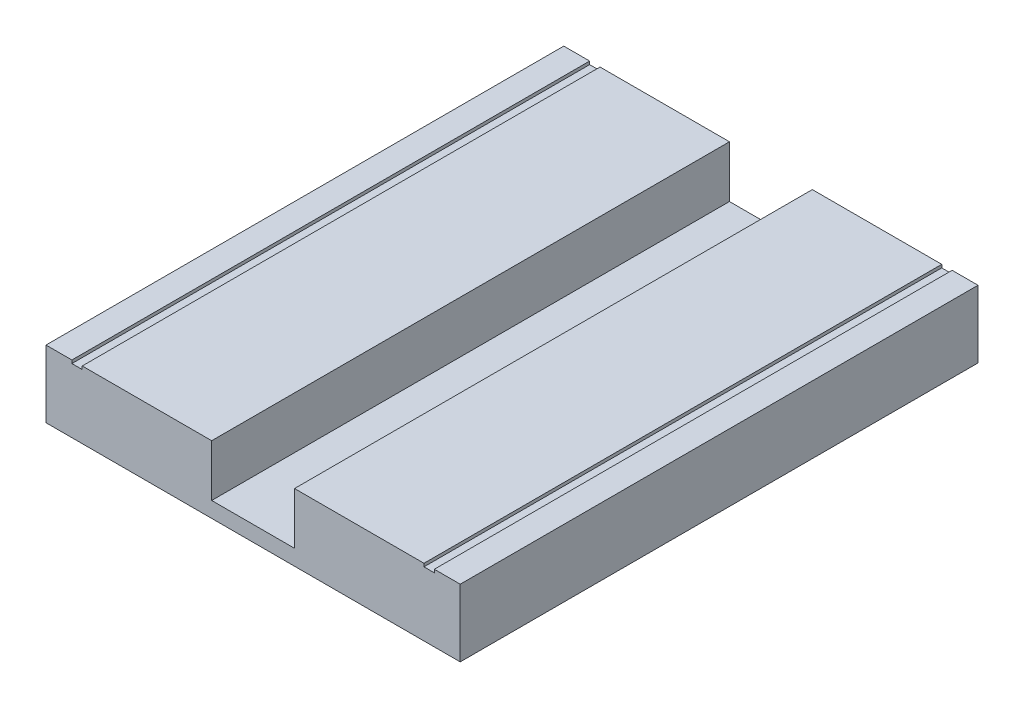
ISO-10303-21;
HEADER;
FILE_DESCRIPTION(('STEP AP214'),'2;1');
FILE_NAME('part.step','',(''),(''),'','','');
FILE_SCHEMA(('AUTOMOTIVE_DESIGN { 1 0 10303 214 1 1 1 1 }'));
ENDSEC;
DATA;
#1=APPLICATION_CONTEXT('core data for automotive mechanical design processes');
#2=APPLICATION_PROTOCOL_DEFINITION('international standard','automotive_design',2000,#1);
#3=PRODUCT_CONTEXT('',#1,'mechanical');
#4=PRODUCT('Part','Part','',(#3));
#5=PRODUCT_RELATED_PRODUCT_CATEGORY('part','',(#4));
#6=PRODUCT_DEFINITION_FORMATION('','',#4);
#7=PRODUCT_DEFINITION_CONTEXT('part definition',#1,'design');
#8=PRODUCT_DEFINITION('design','',#6,#7);
#9=PRODUCT_DEFINITION_SHAPE('','',#8);
#10=(LENGTH_UNIT() NAMED_UNIT(*) SI_UNIT(.MILLI.,.METRE.));
#11=(NAMED_UNIT(*) PLANE_ANGLE_UNIT() SI_UNIT($,.RADIAN.));
#12=(NAMED_UNIT(*) SI_UNIT($,.STERADIAN.) SOLID_ANGLE_UNIT());
#13=UNCERTAINTY_MEASURE_WITH_UNIT(LENGTH_MEASURE(1.E-05),#10,'distance_accuracy_value','');
#14=(GEOMETRIC_REPRESENTATION_CONTEXT(3) GLOBAL_UNCERTAINTY_ASSIGNED_CONTEXT((#13)) GLOBAL_UNIT_ASSIGNED_CONTEXT((#10,
#11,#12)) REPRESENTATION_CONTEXT('',''));
#15=CARTESIAN_POINT('',(0.,0.,0.));
#16=DIRECTION('',(0.,0.,1.));
#17=DIRECTION('',(1.,0.,0.));
#18=AXIS2_PLACEMENT_3D('',#15,#16,#17);
#19=CARTESIAN_POINT('',(0.,-10.,0.));
#20=DIRECTION('',(0.,-1.,0.));
#21=DIRECTION('',(0.,0.,-1.));
#22=AXIS2_PLACEMENT_3D('',#19,#20,#21);
#23=PLANE('',#22);
#24=DIRECTION('',(0.,0.,1.));
#25=VECTOR('',#24,1.);
#26=CARTESIAN_POINT('',(-7.99999999999999,-10.,100.));
#27=LINE('',#26,#25);
#28=CARTESIAN_POINT('',(-8.,-10.,0.));
#29=VERTEX_POINT('',#28);
#30=CARTESIAN_POINT('',(-7.99999999999999,-10.,100.));
#31=VERTEX_POINT('',#30);
#32=EDGE_CURVE('E149',#29,#31,#27,.T.);
#33=ORIENTED_EDGE('',*,*,#32,.T.);
#34=DIRECTION('',(-1.,0.,0.));
#35=VECTOR('',#34,1.);
#36=CARTESIAN_POINT('',(40.,-10.,100.));
#37=LINE('',#36,#35);
#38=CARTESIAN_POINT('',(8.,-10.,100.));
#39=VERTEX_POINT('',#38);
#40=EDGE_CURVE('E153',#39,#31,#37,.T.);
#41=ORIENTED_EDGE('',*,*,#40,.F.);
#42=DIRECTION('',(0.,0.,-1.));
#43=VECTOR('',#42,1.);
#44=CARTESIAN_POINT('',(8.,-10.,100.));
#45=LINE('',#44,#43);
#46=CARTESIAN_POINT('',(8.,-10.,0.));
#47=VERTEX_POINT('',#46);
#48=EDGE_CURVE('E50',#39,#47,#45,.T.);
#49=ORIENTED_EDGE('',*,*,#48,.T.);
#50=DIRECTION('',(1.,0.,0.));
#51=VECTOR('',#50,1.);
#52=CARTESIAN_POINT('',(40.,-10.,0.));
#53=LINE('',#52,#51);
#54=EDGE_CURVE('E186',#29,#47,#53,.T.);
#55=ORIENTED_EDGE('',*,*,#54,.F.);
#56=EDGE_LOOP('',(#33,#41,#49,#55));
#57=FACE_BOUND('',#56,.T.);
#58=ADVANCED_FACE('F33',(#57),#23,.F.);
#59=CARTESIAN_POINT('',(-40.,0.,100.));
#60=DIRECTION('',(0.,1.,0.));
#61=DIRECTION('',(0.,0.,1.));
#62=AXIS2_PLACEMENT_3D('',#59,#60,#61);
#63=PLANE('',#62);
#64=DIRECTION('',(0.,0.,-1.));
#65=VECTOR('',#64,1.);
#66=CARTESIAN_POINT('',(8.,0.,100.));
#67=LINE('',#66,#65);
#68=CARTESIAN_POINT('',(8.,0.,100.));
#69=VERTEX_POINT('',#68);
#70=CARTESIAN_POINT('',(8.,0.,0.));
#71=VERTEX_POINT('',#70);
#72=EDGE_CURVE('E43',#69,#71,#67,.T.);
#73=ORIENTED_EDGE('',*,*,#72,.F.);
#74=DIRECTION('',(1.,0.,0.));
#75=VECTOR('',#74,1.);
#76=CARTESIAN_POINT('',(-40.,0.,100.));
#77=LINE('',#76,#75);
#78=CARTESIAN_POINT('',(33.,0.,100.));
#79=VERTEX_POINT('',#78);
#80=EDGE_CURVE('E199',#69,#79,#77,.T.);
#81=ORIENTED_EDGE('',*,*,#80,.T.);
#82=DIRECTION('',(0.,0.,1.));
#83=VECTOR('',#82,1.);
#84=CARTESIAN_POINT('',(33.,0.,100.));
#85=LINE('',#84,#83);
#86=CARTESIAN_POINT('',(33.,0.,0.));
#87=VERTEX_POINT('',#86);
#88=EDGE_CURVE('E218',#87,#79,#85,.T.);
#89=ORIENTED_EDGE('',*,*,#88,.F.);
#90=DIRECTION('',(1.,0.,0.));
#91=VECTOR('',#90,1.);
#92=CARTESIAN_POINT('',(-40.,0.,0.));
#93=LINE('',#92,#91);
#94=EDGE_CURVE('E37',#71,#87,#93,.T.);
#95=ORIENTED_EDGE('',*,*,#94,.F.);
#96=EDGE_LOOP('',(#73,#81,#89,#95));
#97=FACE_BOUND('',#96,.T.);
#98=ADVANCED_FACE('F272',(#97),#63,.T.);
#99=CARTESIAN_POINT('',(0.,0.,100.));
#100=DIRECTION('',(0.,0.,-1.));
#101=DIRECTION('',(-1.,0.,0.));
#102=AXIS2_PLACEMENT_3D('',#99,#100,#101);
#103=PLANE('',#102);
#104=ORIENTED_EDGE('',*,*,#80,.F.);
#105=DIRECTION('',(0.,1.,0.));
#106=VECTOR('',#105,1.);
#107=CARTESIAN_POINT('',(8.,-11.,100.));
#108=LINE('',#107,#106);
#109=EDGE_CURVE('E230',#39,#69,#108,.T.);
#110=ORIENTED_EDGE('',*,*,#109,.F.);
#111=ORIENTED_EDGE('',*,*,#40,.T.);
#112=DIRECTION('',(0.,1.,0.));
#113=VECTOR('',#112,1.);
#114=CARTESIAN_POINT('',(-7.99999999999999,-11.,100.));
#115=LINE('',#114,#113);
#116=CARTESIAN_POINT('',(-7.99999999999999,0.,100.));
#117=VERTEX_POINT('',#116);
#118=EDGE_CURVE('E164',#31,#117,#115,.T.);
#119=ORIENTED_EDGE('',*,*,#118,.T.);
#120=DIRECTION('',(1.,0.,0.));
#121=VECTOR('',#120,1.);
#122=CARTESIAN_POINT('',(-40.,0.,100.));
#123=LINE('',#122,#121);
#124=CARTESIAN_POINT('',(-33.,0.,100.));
#125=VERTEX_POINT('',#124);
#126=EDGE_CURVE('E163',#125,#117,#123,.T.);
#127=ORIENTED_EDGE('',*,*,#126,.F.);
#128=DIRECTION('',(0.,1.,0.));
#129=VECTOR('',#128,1.);
#130=CARTESIAN_POINT('',(-33.,-0.6,100.));
#131=LINE('',#130,#129);
#132=CARTESIAN_POINT('',(-33.,-0.6,100.));
#133=VERTEX_POINT('',#132);
#134=EDGE_CURVE('E174',#133,#125,#131,.T.);
#135=ORIENTED_EDGE('',*,*,#134,.F.);
#136=DIRECTION('',(1.,0.,0.));
#137=VECTOR('',#136,1.);
#138=CARTESIAN_POINT('',(-35.,-0.6,100.));
#139=LINE('',#138,#137);
#140=CARTESIAN_POINT('',(-35.,-0.6,100.));
#141=VERTEX_POINT('',#140);
#142=EDGE_CURVE('E449',#141,#133,#139,.T.);
#143=ORIENTED_EDGE('',*,*,#142,.F.);
#144=DIRECTION('',(0.,1.,0.));
#145=VECTOR('',#144,1.);
#146=CARTESIAN_POINT('',(-35.,-0.6,100.));
#147=LINE('',#146,#145);
#148=CARTESIAN_POINT('',(-35.,0.,100.));
#149=VERTEX_POINT('',#148);
#150=EDGE_CURVE('E456',#141,#149,#147,.T.);
#151=ORIENTED_EDGE('',*,*,#150,.T.);
#152=CARTESIAN_POINT('',(-40.,0.,100.));
#153=VERTEX_POINT('',#152);
#154=EDGE_CURVE('E178',#153,#149,#123,.T.);
#155=ORIENTED_EDGE('',*,*,#154,.F.);
#156=DIRECTION('',(0.,1.,0.));
#157=VECTOR('',#156,1.);
#158=CARTESIAN_POINT('',(-40.,-13.,100.));
#159=LINE('',#158,#157);
#160=CARTESIAN_POINT('',(-40.,-13.,100.));
#161=VERTEX_POINT('',#160);
#162=EDGE_CURVE('E198',#161,#153,#159,.T.);
#163=ORIENTED_EDGE('',*,*,#162,.F.);
#164=DIRECTION('',(-1.,0.,0.));
#165=VECTOR('',#164,1.);
#166=CARTESIAN_POINT('',(40.,-13.,100.));
#167=LINE('',#166,#165);
#168=CARTESIAN_POINT('',(40.,-13.,100.));
#169=VERTEX_POINT('',#168);
#170=EDGE_CURVE('E185',#169,#161,#167,.T.);
#171=ORIENTED_EDGE('',*,*,#170,.F.);
#172=DIRECTION('',(0.,-1.,0.));
#173=VECTOR('',#172,1.);
#174=CARTESIAN_POINT('',(40.,0.,100.));
#175=LINE('',#174,#173);
#176=CARTESIAN_POINT('',(40.,0.,100.));
#177=VERTEX_POINT('',#176);
#178=EDGE_CURVE('E204',#177,#169,#175,.T.);
#179=ORIENTED_EDGE('',*,*,#178,.F.);
#180=CARTESIAN_POINT('',(35.,0.,100.));
#181=VERTEX_POINT('',#180);
#182=EDGE_CURVE('E205',#181,#177,#77,.T.);
#183=ORIENTED_EDGE('',*,*,#182,.F.);
#184=DIRECTION('',(0.,1.,0.));
#185=VECTOR('',#184,1.);
#186=CARTESIAN_POINT('',(35.,-0.6,100.));
#187=LINE('',#186,#185);
#188=CARTESIAN_POINT('',(35.,-0.6,100.));
#189=VERTEX_POINT('',#188);
#190=EDGE_CURVE('E222',#189,#181,#187,.T.);
#191=ORIENTED_EDGE('',*,*,#190,.F.);
#192=DIRECTION('',(1.,0.,0.));
#193=VECTOR('',#192,1.);
#194=CARTESIAN_POINT('',(35.,-0.6,100.));
#195=LINE('',#194,#193);
#196=CARTESIAN_POINT('',(33.,-0.6,100.));
#197=VERTEX_POINT('',#196);
#198=EDGE_CURVE('E227',#197,#189,#195,.T.);
#199=ORIENTED_EDGE('',*,*,#198,.F.);
#200=DIRECTION('',(0.,1.,0.));
#201=VECTOR('',#200,1.);
#202=CARTESIAN_POINT('',(33.,-0.6,100.));
#203=LINE('',#202,#201);
#204=EDGE_CURVE('E219',#197,#79,#203,.T.);
#205=ORIENTED_EDGE('',*,*,#204,.T.);
#206=EDGE_LOOP('',(#104,#110,#111,#119,#127,#135,#143,#151,#155,#163,#171,#179,#183,#191,#199,#205));
#207=FACE_BOUND('',#206,.T.);
#208=ADVANCED_FACE('F258',(#207),#103,.F.);
#209=CARTESIAN_POINT('',(0.,0.,0.));
#210=DIRECTION('',(0.,0.,-1.));
#211=DIRECTION('',(-1.,0.,0.));
#212=AXIS2_PLACEMENT_3D('',#209,#210,#211);
#213=PLANE('',#212);
#214=DIRECTION('',(0.,-1.,0.));
#215=VECTOR('',#214,1.);
#216=CARTESIAN_POINT('',(8.,0.,0.));
#217=LINE('',#216,#215);
#218=EDGE_CURVE('E11',#71,#47,#217,.T.);
#219=ORIENTED_EDGE('',*,*,#218,.F.);
#220=ORIENTED_EDGE('',*,*,#94,.T.);
#221=DIRECTION('',(0.,1.,0.));
#222=VECTOR('',#221,1.);
#223=CARTESIAN_POINT('',(33.,-0.6,0.));
#224=LINE('',#223,#222);
#225=CARTESIAN_POINT('',(33.,-0.6,0.));
#226=VERTEX_POINT('',#225);
#227=EDGE_CURVE('E214',#226,#87,#224,.T.);
#228=ORIENTED_EDGE('',*,*,#227,.F.);
#229=DIRECTION('',(-1.,0.,0.));
#230=VECTOR('',#229,1.);
#231=CARTESIAN_POINT('',(33.,-0.6,0.));
#232=LINE('',#231,#230);
#233=CARTESIAN_POINT('',(35.,-0.6,0.));
#234=VERTEX_POINT('',#233);
#235=EDGE_CURVE('E234',#234,#226,#232,.T.);
#236=ORIENTED_EDGE('',*,*,#235,.F.);
#237=DIRECTION('',(0.,1.,0.));
#238=VECTOR('',#237,1.);
#239=CARTESIAN_POINT('',(35.,-0.6,0.));
#240=LINE('',#239,#238);
#241=CARTESIAN_POINT('',(35.,0.,0.));
#242=VERTEX_POINT('',#241);
#243=EDGE_CURVE('E211',#234,#242,#240,.T.);
#244=ORIENTED_EDGE('',*,*,#243,.T.);
#245=CARTESIAN_POINT('',(40.,0.,0.));
#246=VERTEX_POINT('',#245);
#247=EDGE_CURVE('E208',#242,#246,#93,.T.);
#248=ORIENTED_EDGE('',*,*,#247,.T.);
#249=DIRECTION('',(0.,-1.,0.));
#250=VECTOR('',#249,1.);
#251=CARTESIAN_POINT('',(40.,0.,0.));
#252=LINE('',#251,#250);
#253=CARTESIAN_POINT('',(40.,-13.,0.));
#254=VERTEX_POINT('',#253);
#255=EDGE_CURVE('E206',#246,#254,#252,.T.);
#256=ORIENTED_EDGE('',*,*,#255,.T.);
#257=DIRECTION('',(1.,0.,0.));
#258=VECTOR('',#257,1.);
#259=CARTESIAN_POINT('',(40.,-13.,0.));
#260=LINE('',#259,#258);
#261=CARTESIAN_POINT('',(-40.,-13.,0.));
#262=VERTEX_POINT('',#261);
#263=EDGE_CURVE('E190',#262,#254,#260,.T.);
#264=ORIENTED_EDGE('',*,*,#263,.F.);
#265=DIRECTION('',(0.,1.,0.));
#266=VECTOR('',#265,1.);
#267=CARTESIAN_POINT('',(-40.,-13.,0.));
#268=LINE('',#267,#266);
#269=CARTESIAN_POINT('',(-40.,0.,0.));
#270=VERTEX_POINT('',#269);
#271=EDGE_CURVE('E193',#262,#270,#268,.T.);
#272=ORIENTED_EDGE('',*,*,#271,.T.);
#273=DIRECTION('',(1.,0.,0.));
#274=VECTOR('',#273,1.);
#275=CARTESIAN_POINT('',(-40.,0.,0.));
#276=LINE('',#275,#274);
#277=CARTESIAN_POINT('',(-35.,0.,0.));
#278=VERTEX_POINT('',#277);
#279=EDGE_CURVE('E171',#270,#278,#276,.T.);
#280=ORIENTED_EDGE('',*,*,#279,.T.);
#281=DIRECTION('',(0.,1.,0.));
#282=VECTOR('',#281,1.);
#283=CARTESIAN_POINT('',(-35.,-0.6,0.));
#284=LINE('',#283,#282);
#285=CARTESIAN_POINT('',(-35.,-0.6,0.));
#286=VERTEX_POINT('',#285);
#287=EDGE_CURVE('E452',#286,#278,#284,.T.);
#288=ORIENTED_EDGE('',*,*,#287,.F.);
#289=DIRECTION('',(-1.,0.,0.));
#290=VECTOR('',#289,1.);
#291=CARTESIAN_POINT('',(-33.,-0.6,0.));
#292=LINE('',#291,#290);
#293=CARTESIAN_POINT('',(-33.,-0.6,0.));
#294=VERTEX_POINT('',#293);
#295=EDGE_CURVE('E443',#294,#286,#292,.T.);
#296=ORIENTED_EDGE('',*,*,#295,.F.);
#297=DIRECTION('',(0.,1.,0.));
#298=VECTOR('',#297,1.);
#299=CARTESIAN_POINT('',(-33.,-0.6,0.));
#300=LINE('',#299,#298);
#301=CARTESIAN_POINT('',(-33.,0.,0.));
#302=VERTEX_POINT('',#301);
#303=EDGE_CURVE('E170',#294,#302,#300,.T.);
#304=ORIENTED_EDGE('',*,*,#303,.T.);
#305=CARTESIAN_POINT('',(-8.,0.,0.));
#306=VERTEX_POINT('',#305);
#307=EDGE_CURVE('E161',#302,#306,#276,.T.);
#308=ORIENTED_EDGE('',*,*,#307,.T.);
#309=DIRECTION('',(0.,1.,0.));
#310=VECTOR('',#309,1.);
#311=CARTESIAN_POINT('',(-8.,0.,0.));
#312=LINE('',#311,#310);
#313=EDGE_CURVE('E143',#29,#306,#312,.T.);
#314=ORIENTED_EDGE('',*,*,#313,.F.);
#315=ORIENTED_EDGE('',*,*,#54,.T.);
#316=EDGE_LOOP('',(#219,#220,#228,#236,#244,#248,#256,#264,#272,#280,#288,#296,#304,#308,#314,#315));
#317=FACE_BOUND('',#316,.T.);
#318=ADVANCED_FACE('F35',(#317),#213,.T.);
#319=DIRECTION('',(0.,0.,-1.));
#320=VECTOR('',#319,1.);
#321=CARTESIAN_POINT('',(35.,0.,0.));
#322=LINE('',#321,#320);
#323=EDGE_CURVE('E210',#181,#242,#322,.T.);
#324=ORIENTED_EDGE('',*,*,#323,.F.);
#325=ORIENTED_EDGE('',*,*,#182,.T.);
#326=DIRECTION('',(0.,0.,-1.));
#327=VECTOR('',#326,1.);
#328=CARTESIAN_POINT('',(40.,0.,100.));
#329=LINE('',#328,#327);
#330=EDGE_CURVE('E201',#177,#246,#329,.T.);
#331=ORIENTED_EDGE('',*,*,#330,.T.);
#332=ORIENTED_EDGE('',*,*,#247,.F.);
#333=EDGE_LOOP('',(#324,#325,#331,#332));
#334=FACE_BOUND('',#333,.T.);
#335=ADVANCED_FACE('F248',(#334),#63,.T.);
#336=CARTESIAN_POINT('',(40.,0.,100.));
#337=DIRECTION('',(1.,0.,0.));
#338=DIRECTION('',(0.,0.,-1.));
#339=AXIS2_PLACEMENT_3D('',#336,#337,#338);
#340=PLANE('',#339);
#341=ORIENTED_EDGE('',*,*,#255,.F.);
#342=ORIENTED_EDGE('',*,*,#330,.F.);
#343=ORIENTED_EDGE('',*,*,#178,.T.);
#344=DIRECTION('',(0.,0.,1.));
#345=VECTOR('',#344,1.);
#346=CARTESIAN_POINT('',(40.,-13.,0.));
#347=LINE('',#346,#345);
#348=EDGE_CURVE('E182',#254,#169,#347,.T.);
#349=ORIENTED_EDGE('',*,*,#348,.F.);
#350=EDGE_LOOP('',(#341,#342,#343,#349));
#351=FACE_BOUND('',#350,.T.);
#352=ADVANCED_FACE('F255',(#351),#340,.T.);
#353=CARTESIAN_POINT('',(35.,-0.6,0.));
#354=DIRECTION('',(1.,0.,0.));
#355=DIRECTION('',(0.,0.,-1.));
#356=AXIS2_PLACEMENT_3D('',#353,#354,#355);
#357=PLANE('',#356);
#358=ORIENTED_EDGE('',*,*,#323,.T.);
#359=ORIENTED_EDGE('',*,*,#243,.F.);
#360=DIRECTION('',(0.,0.,-1.));
#361=VECTOR('',#360,1.);
#362=CARTESIAN_POINT('',(35.,-0.6,0.));
#363=LINE('',#362,#361);
#364=EDGE_CURVE('E217',#189,#234,#363,.T.);
#365=ORIENTED_EDGE('',*,*,#364,.F.);
#366=ORIENTED_EDGE('',*,*,#190,.T.);
#367=EDGE_LOOP('',(#358,#359,#365,#366));
#368=FACE_BOUND('',#367,.T.);
#369=ADVANCED_FACE('F287',(#368),#357,.F.);
#370=CARTESIAN_POINT('',(33.,-0.6,100.));
#371=DIRECTION('',(-1.,0.,0.));
#372=DIRECTION('',(0.,0.,1.));
#373=AXIS2_PLACEMENT_3D('',#370,#371,#372);
#374=PLANE('',#373);
#375=ORIENTED_EDGE('',*,*,#88,.T.);
#376=ORIENTED_EDGE('',*,*,#204,.F.);
#377=DIRECTION('',(0.,0.,1.));
#378=VECTOR('',#377,1.);
#379=CARTESIAN_POINT('',(33.,-0.6,100.));
#380=LINE('',#379,#378);
#381=EDGE_CURVE('E231',#226,#197,#380,.T.);
#382=ORIENTED_EDGE('',*,*,#381,.F.);
#383=ORIENTED_EDGE('',*,*,#227,.T.);
#384=EDGE_LOOP('',(#375,#376,#382,#383));
#385=FACE_BOUND('',#384,.T.);
#386=ADVANCED_FACE('F271',(#385),#374,.F.);
#387=CARTESIAN_POINT('',(0.,-0.6,0.));
#388=DIRECTION('',(0.,-1.,0.));
#389=DIRECTION('',(0.,0.,-1.));
#390=AXIS2_PLACEMENT_3D('',#387,#388,#389);
#391=PLANE('',#390);
#392=ORIENTED_EDGE('',*,*,#364,.T.);
#393=ORIENTED_EDGE('',*,*,#235,.T.);
#394=ORIENTED_EDGE('',*,*,#381,.T.);
#395=ORIENTED_EDGE('',*,*,#198,.T.);
#396=EDGE_LOOP('',(#392,#393,#394,#395));
#397=FACE_BOUND('',#396,.T.);
#398=ADVANCED_FACE('F309',(#397),#391,.F.);
#399=CARTESIAN_POINT('',(8.,-11.,100.));
#400=DIRECTION('',(1.,0.,0.));
#401=DIRECTION('',(0.,0.,-1.));
#402=AXIS2_PLACEMENT_3D('',#399,#400,#401);
#403=PLANE('',#402);
#404=ORIENTED_EDGE('',*,*,#109,.T.);
#405=ORIENTED_EDGE('',*,*,#72,.T.);
#406=ORIENTED_EDGE('',*,*,#218,.T.);
#407=ORIENTED_EDGE('',*,*,#48,.F.);
#408=EDGE_LOOP('',(#404,#405,#406,#407));
#409=FACE_BOUND('',#408,.T.);
#410=ADVANCED_FACE('F314',(#409),#403,.F.);
#411=CARTESIAN_POINT('',(-40.,-13.,0.));
#412=DIRECTION('',(1.,0.,0.));
#413=DIRECTION('',(0.,0.,-1.));
#414=AXIS2_PLACEMENT_3D('',#411,#412,#413);
#415=PLANE('',#414);
#416=ORIENTED_EDGE('',*,*,#162,.T.);
#417=DIRECTION('',(0.,0.,-1.));
#418=VECTOR('',#417,1.);
#419=CARTESIAN_POINT('',(-40.,0.,100.));
#420=LINE('',#419,#418);
#421=EDGE_CURVE('E154',#153,#270,#420,.T.);
#422=ORIENTED_EDGE('',*,*,#421,.T.);
#423=ORIENTED_EDGE('',*,*,#271,.F.);
#424=DIRECTION('',(0.,0.,-1.));
#425=VECTOR('',#424,1.);
#426=CARTESIAN_POINT('',(-40.,-13.,0.));
#427=LINE('',#426,#425);
#428=EDGE_CURVE('E188',#161,#262,#427,.T.);
#429=ORIENTED_EDGE('',*,*,#428,.F.);
#430=EDGE_LOOP('',(#416,#422,#423,#429));
#431=FACE_BOUND('',#430,.T.);
#432=ADVANCED_FACE('F362',(#431),#415,.F.);
#433=CARTESIAN_POINT('',(0.,-13.,0.));
#434=DIRECTION('',(0.,-1.,0.));
#435=DIRECTION('',(0.,0.,-1.));
#436=AXIS2_PLACEMENT_3D('',#433,#434,#435);
#437=PLANE('',#436);
#438=ORIENTED_EDGE('',*,*,#348,.T.);
#439=ORIENTED_EDGE('',*,*,#170,.T.);
#440=ORIENTED_EDGE('',*,*,#428,.T.);
#441=ORIENTED_EDGE('',*,*,#263,.T.);
#442=EDGE_LOOP('',(#438,#439,#440,#441));
#443=FACE_BOUND('',#442,.T.);
#444=ADVANCED_FACE('F263',(#443),#437,.T.);
#445=CARTESIAN_POINT('',(-33.,-0.6,100.));
#446=DIRECTION('',(1.,0.,0.));
#447=DIRECTION('',(0.,0.,-1.));
#448=AXIS2_PLACEMENT_3D('',#445,#446,#447);
#449=PLANE('',#448);
#450=DIRECTION('',(0.,0.,-1.));
#451=VECTOR('',#450,1.);
#452=CARTESIAN_POINT('',(-33.,0.,100.));
#453=LINE('',#452,#451);
#454=EDGE_CURVE('E439',#125,#302,#453,.T.);
#455=ORIENTED_EDGE('',*,*,#454,.T.);
#456=ORIENTED_EDGE('',*,*,#303,.F.);
#457=DIRECTION('',(0.,0.,-1.));
#458=VECTOR('',#457,1.);
#459=CARTESIAN_POINT('',(-33.,-0.6,100.));
#460=LINE('',#459,#458);
#461=EDGE_CURVE('E451',#133,#294,#460,.T.);
#462=ORIENTED_EDGE('',*,*,#461,.F.);
#463=ORIENTED_EDGE('',*,*,#134,.T.);
#464=EDGE_LOOP('',(#455,#456,#462,#463));
#465=FACE_BOUND('',#464,.T.);
#466=ADVANCED_FACE('F378',(#465),#449,.F.);
#467=CARTESIAN_POINT('',(0.,-0.6,0.));
#468=DIRECTION('',(0.,1.,0.));
#469=DIRECTION('',(0.,0.,1.));
#470=AXIS2_PLACEMENT_3D('',#467,#468,#469);
#471=PLANE('',#470);
#472=ORIENTED_EDGE('',*,*,#295,.T.);
#473=DIRECTION('',(0.,0.,1.));
#474=VECTOR('',#473,1.);
#475=CARTESIAN_POINT('',(-35.,-0.6,0.));
#476=LINE('',#475,#474);
#477=EDGE_CURVE('E446',#286,#141,#476,.T.);
#478=ORIENTED_EDGE('',*,*,#477,.T.);
#479=ORIENTED_EDGE('',*,*,#142,.T.);
#480=ORIENTED_EDGE('',*,*,#461,.T.);
#481=EDGE_LOOP('',(#472,#478,#479,#480));
#482=FACE_BOUND('',#481,.T.);
#483=ADVANCED_FACE('F387',(#482),#471,.T.);
#484=CARTESIAN_POINT('',(-35.,-0.6,0.));
#485=DIRECTION('',(-1.,0.,0.));
#486=DIRECTION('',(0.,0.,1.));
#487=AXIS2_PLACEMENT_3D('',#484,#485,#486);
#488=PLANE('',#487);
#489=DIRECTION('',(0.,0.,1.));
#490=VECTOR('',#489,1.);
#491=CARTESIAN_POINT('',(-35.,0.,0.));
#492=LINE('',#491,#490);
#493=EDGE_CURVE('E437',#278,#149,#492,.T.);
#494=ORIENTED_EDGE('',*,*,#493,.T.);
#495=ORIENTED_EDGE('',*,*,#150,.F.);
#496=ORIENTED_EDGE('',*,*,#477,.F.);
#497=ORIENTED_EDGE('',*,*,#287,.T.);
#498=EDGE_LOOP('',(#494,#495,#496,#497));
#499=FACE_BOUND('',#498,.T.);
#500=ADVANCED_FACE('F397',(#499),#488,.F.);
#501=CARTESIAN_POINT('',(-40.,0.,100.));
#502=DIRECTION('',(0.,1.,0.));
#503=DIRECTION('',(0.,0.,1.));
#504=AXIS2_PLACEMENT_3D('',#501,#502,#503);
#505=PLANE('',#504);
#506=ORIENTED_EDGE('',*,*,#493,.F.);
#507=ORIENTED_EDGE('',*,*,#279,.F.);
#508=ORIENTED_EDGE('',*,*,#421,.F.);
#509=ORIENTED_EDGE('',*,*,#154,.T.);
#510=EDGE_LOOP('',(#506,#507,#508,#509));
#511=FACE_BOUND('',#510,.T.);
#512=ADVANCED_FACE('F407',(#511),#505,.T.);
#513=DIRECTION('',(0.,0.,1.));
#514=VECTOR('',#513,1.);
#515=CARTESIAN_POINT('',(-8.,0.,0.));
#516=LINE('',#515,#514);
#517=EDGE_CURVE('E146',#306,#117,#516,.T.);
#518=ORIENTED_EDGE('',*,*,#517,.F.);
#519=ORIENTED_EDGE('',*,*,#307,.F.);
#520=ORIENTED_EDGE('',*,*,#454,.F.);
#521=ORIENTED_EDGE('',*,*,#126,.T.);
#522=EDGE_LOOP('',(#518,#519,#520,#521));
#523=FACE_BOUND('',#522,.T.);
#524=ADVANCED_FACE('F159',(#523),#505,.T.);
#525=CARTESIAN_POINT('',(-8.,-11.,0.));
#526=DIRECTION('',(-1.,0.,0.));
#527=DIRECTION('',(0.,0.,1.));
#528=AXIS2_PLACEMENT_3D('',#525,#526,#527);
#529=PLANE('',#528);
#530=ORIENTED_EDGE('',*,*,#313,.T.);
#531=ORIENTED_EDGE('',*,*,#517,.T.);
#532=ORIENTED_EDGE('',*,*,#118,.F.);
#533=ORIENTED_EDGE('',*,*,#32,.F.);
#534=EDGE_LOOP('',(#530,#531,#532,#533));
#535=FACE_BOUND('',#534,.T.);
#536=ADVANCED_FACE('F145',(#535),#529,.F.);
#537=CLOSED_SHELL('',(#58,#98,#208,#318,#335,#352,#369,#386,#398,#410,#432,#444,#466,#483,#500,
#512,#524,#536));
#538=MANIFOLD_SOLID_BREP('B2',#537);
#539=ADVANCED_BREP_SHAPE_REPRESENTATION('',(#18,#538),#14);
#540=SHAPE_DEFINITION_REPRESENTATION(#9,#539);
ENDSEC;
END-ISO-10303-21;
